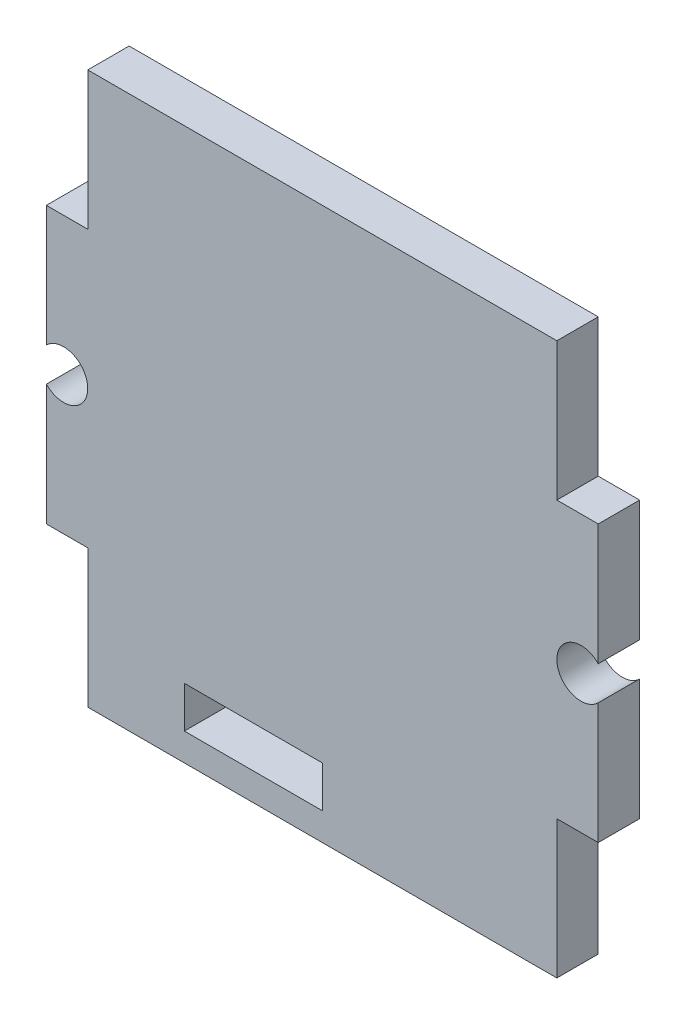
ISO-10303-21;
HEADER;
FILE_DESCRIPTION(('STEP AP214'),'2;1');
FILE_NAME('part.step','',(''),(''),'','','');
FILE_SCHEMA(('AUTOMOTIVE_DESIGN { 1 0 10303 214 1 1 1 1 }'));
ENDSEC;
DATA;
#1=APPLICATION_CONTEXT('core data for automotive mechanical design processes');
#2=APPLICATION_PROTOCOL_DEFINITION('international standard','automotive_design',2000,#1);
#3=PRODUCT_CONTEXT('',#1,'mechanical');
#4=PRODUCT('Part','Part','',(#3));
#5=PRODUCT_RELATED_PRODUCT_CATEGORY('part','',(#4));
#6=PRODUCT_DEFINITION_FORMATION('','',#4);
#7=PRODUCT_DEFINITION_CONTEXT('part definition',#1,'design');
#8=PRODUCT_DEFINITION('design','',#6,#7);
#9=PRODUCT_DEFINITION_SHAPE('','',#8);
#10=(LENGTH_UNIT() NAMED_UNIT(*) SI_UNIT(.MILLI.,.METRE.));
#11=(NAMED_UNIT(*) PLANE_ANGLE_UNIT() SI_UNIT($,.RADIAN.));
#12=(NAMED_UNIT(*) SI_UNIT($,.STERADIAN.) SOLID_ANGLE_UNIT());
#13=UNCERTAINTY_MEASURE_WITH_UNIT(LENGTH_MEASURE(1.E-05),#10,'distance_accuracy_value','');
#14=(GEOMETRIC_REPRESENTATION_CONTEXT(3) GLOBAL_UNCERTAINTY_ASSIGNED_CONTEXT((#13)) GLOBAL_UNIT_ASSIGNED_CONTEXT((#10,
#11,#12)) REPRESENTATION_CONTEXT('',''));
#15=CARTESIAN_POINT('',(0.,0.,0.));
#16=DIRECTION('',(0.,0.,1.));
#17=DIRECTION('',(1.,0.,0.));
#18=AXIS2_PLACEMENT_3D('',#15,#16,#17);
#19=CARTESIAN_POINT('',(-18.75,0.,1.5));
#20=DIRECTION('',(0.,0.,1.));
#21=DIRECTION('',(1.,0.,0.));
#22=AXIS2_PLACEMENT_3D('',#19,#20,#21);
#23=PLANE('',#22);
#24=CARTESIAN_POINT('',(-18.75,0.,1.5));
#25=DIRECTION('',(0.,0.,-1.));
#26=DIRECTION('',(1.,0.,0.));
#27=AXIS2_PLACEMENT_3D('',#24,#25,#26);
#28=CIRCLE('',#27,1.75);
#29=CARTESIAN_POINT('',(-20.,1.22474487139159,1.5));
#30=VERTEX_POINT('',#29);
#31=CARTESIAN_POINT('',(-20.,-1.22474487139159,1.5));
#32=VERTEX_POINT('',#31);
#33=EDGE_CURVE('E208',#30,#32,#28,.T.);
#34=ORIENTED_EDGE('',*,*,#33,.T.);
#35=DIRECTION('',(0.,-1.,0.));
#36=VECTOR('',#35,1.);
#37=CARTESIAN_POINT('',(-20.,-1.22474487139159,1.5));
#38=LINE('',#37,#36);
#39=CARTESIAN_POINT('',(-20.,-10.,1.5));
#40=VERTEX_POINT('',#39);
#41=EDGE_CURVE('E211',#32,#40,#38,.T.);
#42=ORIENTED_EDGE('',*,*,#41,.T.);
#43=DIRECTION('',(1.,0.,0.));
#44=VECTOR('',#43,1.);
#45=CARTESIAN_POINT('',(-17.,-10.,1.5));
#46=LINE('',#45,#44);
#47=CARTESIAN_POINT('',(-17.,-10.,1.5));
#48=VERTEX_POINT('',#47);
#49=EDGE_CURVE('E214',#40,#48,#46,.T.);
#50=ORIENTED_EDGE('',*,*,#49,.T.);
#51=DIRECTION('',(0.,-1.,0.));
#52=VECTOR('',#51,1.);
#53=CARTESIAN_POINT('',(-17.,-20.,1.5));
#54=LINE('',#53,#52);
#55=CARTESIAN_POINT('',(-17.,-20.,1.5));
#56=VERTEX_POINT('',#55);
#57=EDGE_CURVE('E216',#48,#56,#54,.T.);
#58=ORIENTED_EDGE('',*,*,#57,.T.);
#59=DIRECTION('',(1.,0.,0.));
#60=VECTOR('',#59,1.);
#61=CARTESIAN_POINT('',(-17.,-20.,1.5));
#62=LINE('',#61,#60);
#63=CARTESIAN_POINT('',(17.,-20.,1.5));
#64=VERTEX_POINT('',#63);
#65=EDGE_CURVE('E218',#56,#64,#62,.T.);
#66=ORIENTED_EDGE('',*,*,#65,.T.);
#67=DIRECTION('',(0.,1.,0.));
#68=VECTOR('',#67,1.);
#69=CARTESIAN_POINT('',(17.,-20.,1.5));
#70=LINE('',#69,#68);
#71=CARTESIAN_POINT('',(17.,-10.,1.5));
#72=VERTEX_POINT('',#71);
#73=EDGE_CURVE('E220',#64,#72,#70,.T.);
#74=ORIENTED_EDGE('',*,*,#73,.T.);
#75=DIRECTION('',(1.,0.,0.));
#76=VECTOR('',#75,1.);
#77=CARTESIAN_POINT('',(17.,-10.,1.5));
#78=LINE('',#77,#76);
#79=CARTESIAN_POINT('',(20.,-10.,1.5));
#80=VERTEX_POINT('',#79);
#81=EDGE_CURVE('E222',#72,#80,#78,.T.);
#82=ORIENTED_EDGE('',*,*,#81,.T.);
#83=DIRECTION('',(0.,1.,0.));
#84=VECTOR('',#83,1.);
#85=CARTESIAN_POINT('',(20.,-1.22474487139159,1.5));
#86=LINE('',#85,#84);
#87=CARTESIAN_POINT('',(20.,-1.22474487139159,1.5));
#88=VERTEX_POINT('',#87);
#89=EDGE_CURVE('E224',#80,#88,#86,.T.);
#90=ORIENTED_EDGE('',*,*,#89,.T.);
#91=CARTESIAN_POINT('',(18.75,0.,1.5));
#92=DIRECTION('',(0.,0.,-1.));
#93=DIRECTION('',(-1.,0.,0.));
#94=AXIS2_PLACEMENT_3D('',#91,#92,#93);
#95=CIRCLE('',#94,1.75);
#96=CARTESIAN_POINT('',(20.,1.22474487139159,1.5));
#97=VERTEX_POINT('',#96);
#98=EDGE_CURVE('E226',#88,#97,#95,.T.);
#99=ORIENTED_EDGE('',*,*,#98,.T.);
#100=DIRECTION('',(0.,1.,0.));
#101=VECTOR('',#100,1.);
#102=CARTESIAN_POINT('',(20.,10.,1.5));
#103=LINE('',#102,#101);
#104=CARTESIAN_POINT('',(20.,10.,1.5));
#105=VERTEX_POINT('',#104);
#106=EDGE_CURVE('E228',#97,#105,#103,.T.);
#107=ORIENTED_EDGE('',*,*,#106,.T.);
#108=DIRECTION('',(-1.,0.,0.));
#109=VECTOR('',#108,1.);
#110=CARTESIAN_POINT('',(17.,10.,1.5));
#111=LINE('',#110,#109);
#112=CARTESIAN_POINT('',(17.,10.,1.5));
#113=VERTEX_POINT('',#112);
#114=EDGE_CURVE('E230',#105,#113,#111,.T.);
#115=ORIENTED_EDGE('',*,*,#114,.T.);
#116=DIRECTION('',(0.,1.,0.));
#117=VECTOR('',#116,1.);
#118=CARTESIAN_POINT('',(17.,20.,1.5));
#119=LINE('',#118,#117);
#120=CARTESIAN_POINT('',(17.,20.,1.5));
#121=VERTEX_POINT('',#120);
#122=EDGE_CURVE('E232',#113,#121,#119,.T.);
#123=ORIENTED_EDGE('',*,*,#122,.T.);
#124=DIRECTION('',(-1.,0.,0.));
#125=VECTOR('',#124,1.);
#126=CARTESIAN_POINT('',(-17.,20.,1.5));
#127=LINE('',#126,#125);
#128=CARTESIAN_POINT('',(-17.,20.,1.5));
#129=VERTEX_POINT('',#128);
#130=EDGE_CURVE('E234',#121,#129,#127,.T.);
#131=ORIENTED_EDGE('',*,*,#130,.T.);
#132=DIRECTION('',(0.,-1.,0.));
#133=VECTOR('',#132,1.);
#134=CARTESIAN_POINT('',(-17.,20.,1.5));
#135=LINE('',#134,#133);
#136=CARTESIAN_POINT('',(-17.,10.,1.5));
#137=VERTEX_POINT('',#136);
#138=EDGE_CURVE('E236',#129,#137,#135,.T.);
#139=ORIENTED_EDGE('',*,*,#138,.T.);
#140=DIRECTION('',(-1.,0.,0.));
#141=VECTOR('',#140,1.);
#142=CARTESIAN_POINT('',(-17.,10.,1.5));
#143=LINE('',#142,#141);
#144=CARTESIAN_POINT('',(-20.,10.,1.5));
#145=VERTEX_POINT('',#144);
#146=EDGE_CURVE('E238',#137,#145,#143,.T.);
#147=ORIENTED_EDGE('',*,*,#146,.T.);
#148=DIRECTION('',(0.,-1.,0.));
#149=VECTOR('',#148,1.);
#150=CARTESIAN_POINT('',(-20.,10.,1.5));
#151=LINE('',#150,#149);
#152=EDGE_CURVE('E240',#145,#30,#151,.T.);
#153=ORIENTED_EDGE('',*,*,#152,.T.);
#154=EDGE_LOOP('',(#34,#42,#50,#58,#66,#74,#82,#90,#99,#107,#115,#123,#131,#139,#147,#153));
#155=FACE_BOUND('',#154,.T.);
#156=DIRECTION('',(1.,0.,0.));
#157=VECTOR('',#156,1.);
#158=CARTESIAN_POINT('',(-10.,-18.,1.5));
#159=LINE('',#158,#157);
#160=CARTESIAN_POINT('',(-10.,-18.,1.5));
#161=VERTEX_POINT('',#160);
#162=CARTESIAN_POINT('',(0.,-18.,1.5));
#163=VERTEX_POINT('',#162);
#164=EDGE_CURVE('E180',#161,#163,#159,.T.);
#165=ORIENTED_EDGE('',*,*,#164,.F.);
#166=DIRECTION('',(0.,-1.,0.));
#167=VECTOR('',#166,1.);
#168=CARTESIAN_POINT('',(-9.99999999999999,-15.,1.5));
#169=LINE('',#168,#167);
#170=CARTESIAN_POINT('',(-9.99999999999999,-15.,1.5));
#171=VERTEX_POINT('',#170);
#172=EDGE_CURVE('E172',#171,#161,#169,.T.);
#173=ORIENTED_EDGE('',*,*,#172,.F.);
#174=DIRECTION('',(-1.,0.,0.));
#175=VECTOR('',#174,1.);
#176=CARTESIAN_POINT('',(-9.99999999999999,-15.,1.5));
#177=LINE('',#176,#175);
#178=CARTESIAN_POINT('',(0.,-15.,1.5));
#179=VERTEX_POINT('',#178);
#180=EDGE_CURVE('E194',#179,#171,#177,.T.);
#181=ORIENTED_EDGE('',*,*,#180,.F.);
#182=DIRECTION('',(0.,1.,0.));
#183=VECTOR('',#182,1.);
#184=CARTESIAN_POINT('',(0.,-15.,1.5));
#185=LINE('',#184,#183);
#186=EDGE_CURVE('E192',#163,#179,#185,.T.);
#187=ORIENTED_EDGE('',*,*,#186,.F.);
#188=EDGE_LOOP('',(#165,#173,#181,#187));
#189=FACE_BOUND('',#188,.T.);
#190=ADVANCED_FACE('F35',(#155,#189),#23,.T.);
#191=CARTESIAN_POINT('',(-18.75,0.,-1.5));
#192=DIRECTION('',(0.,0.,1.));
#193=DIRECTION('',(1.,0.,0.));
#194=AXIS2_PLACEMENT_3D('',#191,#192,#193);
#195=PLANE('',#194);
#196=CARTESIAN_POINT('',(-18.75,0.,-1.5));
#197=DIRECTION('',(0.,0.,-1.));
#198=DIRECTION('',(1.,0.,0.));
#199=AXIS2_PLACEMENT_3D('',#196,#197,#198);
#200=CIRCLE('',#199,1.75);
#201=CARTESIAN_POINT('',(-20.,1.22474487139159,-1.5));
#202=VERTEX_POINT('',#201);
#203=CARTESIAN_POINT('',(-20.,-1.22474487139159,-1.5));
#204=VERTEX_POINT('',#203);
#205=EDGE_CURVE('E188',#202,#204,#200,.T.);
#206=ORIENTED_EDGE('',*,*,#205,.F.);
#207=DIRECTION('',(0.,-1.,0.));
#208=VECTOR('',#207,1.);
#209=CARTESIAN_POINT('',(-20.,10.,-1.5));
#210=LINE('',#209,#208);
#211=CARTESIAN_POINT('',(-20.,10.,-1.5));
#212=VERTEX_POINT('',#211);
#213=EDGE_CURVE('E212',#212,#202,#210,.T.);
#214=ORIENTED_EDGE('',*,*,#213,.F.);
#215=DIRECTION('',(-1.,0.,0.));
#216=VECTOR('',#215,1.);
#217=CARTESIAN_POINT('',(-17.,10.,-1.5));
#218=LINE('',#217,#216);
#219=CARTESIAN_POINT('',(-17.,10.,-1.5));
#220=VERTEX_POINT('',#219);
#221=EDGE_CURVE('E271',#220,#212,#218,.T.);
#222=ORIENTED_EDGE('',*,*,#221,.F.);
#223=DIRECTION('',(0.,-1.,0.));
#224=VECTOR('',#223,1.);
#225=CARTESIAN_POINT('',(-17.,20.,-1.5));
#226=LINE('',#225,#224);
#227=CARTESIAN_POINT('',(-17.,20.,-1.5));
#228=VERTEX_POINT('',#227);
#229=EDGE_CURVE('E269',#228,#220,#226,.T.);
#230=ORIENTED_EDGE('',*,*,#229,.F.);
#231=DIRECTION('',(-1.,0.,0.));
#232=VECTOR('',#231,1.);
#233=CARTESIAN_POINT('',(-17.,20.,-1.5));
#234=LINE('',#233,#232);
#235=CARTESIAN_POINT('',(17.,20.,-1.5));
#236=VERTEX_POINT('',#235);
#237=EDGE_CURVE('E267',#236,#228,#234,.T.);
#238=ORIENTED_EDGE('',*,*,#237,.F.);
#239=DIRECTION('',(0.,1.,0.));
#240=VECTOR('',#239,1.);
#241=CARTESIAN_POINT('',(17.,20.,-1.5));
#242=LINE('',#241,#240);
#243=CARTESIAN_POINT('',(17.,10.,-1.5));
#244=VERTEX_POINT('',#243);
#245=EDGE_CURVE('E265',#244,#236,#242,.T.);
#246=ORIENTED_EDGE('',*,*,#245,.F.);
#247=DIRECTION('',(-1.,0.,0.));
#248=VECTOR('',#247,1.);
#249=CARTESIAN_POINT('',(17.,10.,-1.5));
#250=LINE('',#249,#248);
#251=CARTESIAN_POINT('',(20.,10.,-1.5));
#252=VERTEX_POINT('',#251);
#253=EDGE_CURVE('E263',#252,#244,#250,.T.);
#254=ORIENTED_EDGE('',*,*,#253,.F.);
#255=DIRECTION('',(0.,1.,0.));
#256=VECTOR('',#255,1.);
#257=CARTESIAN_POINT('',(20.,10.,-1.5));
#258=LINE('',#257,#256);
#259=CARTESIAN_POINT('',(20.,1.22474487139159,-1.5));
#260=VERTEX_POINT('',#259);
#261=EDGE_CURVE('E261',#260,#252,#258,.T.);
#262=ORIENTED_EDGE('',*,*,#261,.F.);
#263=CARTESIAN_POINT('',(18.75,0.,-1.5));
#264=DIRECTION('',(0.,0.,-1.));
#265=DIRECTION('',(-1.,0.,0.));
#266=AXIS2_PLACEMENT_3D('',#263,#264,#265);
#267=CIRCLE('',#266,1.75);
#268=CARTESIAN_POINT('',(20.,-1.22474487139159,-1.5));
#269=VERTEX_POINT('',#268);
#270=EDGE_CURVE('E259',#269,#260,#267,.T.);
#271=ORIENTED_EDGE('',*,*,#270,.F.);
#272=DIRECTION('',(0.,1.,0.));
#273=VECTOR('',#272,1.);
#274=CARTESIAN_POINT('',(20.,-1.22474487139159,-1.5));
#275=LINE('',#274,#273);
#276=CARTESIAN_POINT('',(20.,-10.,-1.5));
#277=VERTEX_POINT('',#276);
#278=EDGE_CURVE('E257',#277,#269,#275,.T.);
#279=ORIENTED_EDGE('',*,*,#278,.F.);
#280=DIRECTION('',(1.,0.,0.));
#281=VECTOR('',#280,1.);
#282=CARTESIAN_POINT('',(17.,-10.,-1.5));
#283=LINE('',#282,#281);
#284=CARTESIAN_POINT('',(17.,-10.,-1.5));
#285=VERTEX_POINT('',#284);
#286=EDGE_CURVE('E255',#285,#277,#283,.T.);
#287=ORIENTED_EDGE('',*,*,#286,.F.);
#288=DIRECTION('',(0.,1.,0.));
#289=VECTOR('',#288,1.);
#290=CARTESIAN_POINT('',(17.,-20.,-1.5));
#291=LINE('',#290,#289);
#292=CARTESIAN_POINT('',(17.,-20.,-1.5));
#293=VERTEX_POINT('',#292);
#294=EDGE_CURVE('E253',#293,#285,#291,.T.);
#295=ORIENTED_EDGE('',*,*,#294,.F.);
#296=DIRECTION('',(1.,0.,0.));
#297=VECTOR('',#296,1.);
#298=CARTESIAN_POINT('',(-17.,-20.,-1.5));
#299=LINE('',#298,#297);
#300=CARTESIAN_POINT('',(-17.,-20.,-1.5));
#301=VERTEX_POINT('',#300);
#302=EDGE_CURVE('E251',#301,#293,#299,.T.);
#303=ORIENTED_EDGE('',*,*,#302,.F.);
#304=DIRECTION('',(0.,-1.,0.));
#305=VECTOR('',#304,1.);
#306=CARTESIAN_POINT('',(-17.,-20.,-1.5));
#307=LINE('',#306,#305);
#308=CARTESIAN_POINT('',(-17.,-10.,-1.5));
#309=VERTEX_POINT('',#308);
#310=EDGE_CURVE('E249',#309,#301,#307,.T.);
#311=ORIENTED_EDGE('',*,*,#310,.F.);
#312=DIRECTION('',(1.,0.,0.));
#313=VECTOR('',#312,1.);
#314=CARTESIAN_POINT('',(-17.,-10.,-1.5));
#315=LINE('',#314,#313);
#316=CARTESIAN_POINT('',(-20.,-10.,-1.5));
#317=VERTEX_POINT('',#316);
#318=EDGE_CURVE('E247',#317,#309,#315,.T.);
#319=ORIENTED_EDGE('',*,*,#318,.F.);
#320=DIRECTION('',(0.,-1.,0.));
#321=VECTOR('',#320,1.);
#322=CARTESIAN_POINT('',(-20.,-1.22474487139159,-1.5));
#323=LINE('',#322,#321);
#324=EDGE_CURVE('E245',#204,#317,#323,.T.);
#325=ORIENTED_EDGE('',*,*,#324,.F.);
#326=EDGE_LOOP('',(#206,#214,#222,#230,#238,#246,#254,#262,#271,#279,#287,#295,#303,#311,#319,#325));
#327=FACE_BOUND('',#326,.T.);
#328=DIRECTION('',(0.,-1.,0.));
#329=VECTOR('',#328,1.);
#330=CARTESIAN_POINT('',(-9.99999999999999,-15.,-1.5));
#331=LINE('',#330,#329);
#332=CARTESIAN_POINT('',(-9.99999999999999,-15.,-1.5));
#333=VERTEX_POINT('',#332);
#334=CARTESIAN_POINT('',(-10.,-18.,-1.5));
#335=VERTEX_POINT('',#334);
#336=EDGE_CURVE('E58',#333,#335,#331,.T.);
#337=ORIENTED_EDGE('',*,*,#336,.T.);
#338=DIRECTION('',(1.,0.,0.));
#339=VECTOR('',#338,1.);
#340=CARTESIAN_POINT('',(-10.,-18.,-1.5));
#341=LINE('',#340,#339);
#342=CARTESIAN_POINT('',(0.,-18.,-1.5));
#343=VERTEX_POINT('',#342);
#344=EDGE_CURVE('E187',#335,#343,#341,.T.);
#345=ORIENTED_EDGE('',*,*,#344,.T.);
#346=DIRECTION('',(0.,1.,0.));
#347=VECTOR('',#346,1.);
#348=CARTESIAN_POINT('',(0.,-15.,-1.5));
#349=LINE('',#348,#347);
#350=CARTESIAN_POINT('',(0.,-15.,-1.5));
#351=VERTEX_POINT('',#350);
#352=EDGE_CURVE('E200',#343,#351,#349,.T.);
#353=ORIENTED_EDGE('',*,*,#352,.T.);
#354=DIRECTION('',(-1.,0.,0.));
#355=VECTOR('',#354,1.);
#356=CARTESIAN_POINT('',(-9.99999999999999,-15.,-1.5));
#357=LINE('',#356,#355);
#358=EDGE_CURVE('E181',#351,#333,#357,.T.);
#359=ORIENTED_EDGE('',*,*,#358,.T.);
#360=EDGE_LOOP('',(#337,#345,#353,#359));
#361=FACE_BOUND('',#360,.T.);
#362=ADVANCED_FACE('F325',(#327,#361),#195,.F.);
#363=CARTESIAN_POINT('',(-18.75,0.,1.5));
#364=DIRECTION('',(0.,0.,-1.));
#365=DIRECTION('',(-1.,0.,0.));
#366=AXIS2_PLACEMENT_3D('',#363,#364,#365);
#367=CYLINDRICAL_SURFACE('',#366,1.75);
#368=ORIENTED_EDGE('',*,*,#205,.T.);
#369=DIRECTION('',(0.,0.,-1.));
#370=VECTOR('',#369,1.);
#371=CARTESIAN_POINT('',(-20.,-1.22474487139159,1.5));
#372=LINE('',#371,#370);
#373=EDGE_CURVE('E11',#32,#204,#372,.T.);
#374=ORIENTED_EDGE('',*,*,#373,.F.);
#375=ORIENTED_EDGE('',*,*,#33,.F.);
#376=DIRECTION('',(0.,0.,-1.));
#377=VECTOR('',#376,1.);
#378=CARTESIAN_POINT('',(-20.,1.22474487139159,1.5));
#379=LINE('',#378,#377);
#380=EDGE_CURVE('E242',#30,#202,#379,.T.);
#381=ORIENTED_EDGE('',*,*,#380,.T.);
#382=EDGE_LOOP('',(#368,#374,#375,#381));
#383=FACE_BOUND('',#382,.T.);
#384=ADVANCED_FACE('F37',(#383),#367,.F.);
#385=CARTESIAN_POINT('',(-20.,-1.22474487139159,1.5));
#386=DIRECTION('',(1.,0.,0.));
#387=DIRECTION('',(0.,0.,-1.));
#388=AXIS2_PLACEMENT_3D('',#385,#386,#387);
#389=PLANE('',#388);
#390=ORIENTED_EDGE('',*,*,#324,.T.);
#391=DIRECTION('',(0.,0.,-1.));
#392=VECTOR('',#391,1.);
#393=CARTESIAN_POINT('',(-20.,-10.,1.5));
#394=LINE('',#393,#392);
#395=EDGE_CURVE('E43',#40,#317,#394,.T.);
#396=ORIENTED_EDGE('',*,*,#395,.F.);
#397=ORIENTED_EDGE('',*,*,#41,.F.);
#398=ORIENTED_EDGE('',*,*,#373,.T.);
#399=EDGE_LOOP('',(#390,#396,#397,#398));
#400=FACE_BOUND('',#399,.T.);
#401=ADVANCED_FACE('F342',(#400),#389,.F.);
#402=CARTESIAN_POINT('',(-17.,-10.,1.5));
#403=DIRECTION('',(0.,1.,0.));
#404=DIRECTION('',(0.,0.,1.));
#405=AXIS2_PLACEMENT_3D('',#402,#403,#404);
#406=PLANE('',#405);
#407=ORIENTED_EDGE('',*,*,#318,.T.);
#408=DIRECTION('',(0.,0.,-1.));
#409=VECTOR('',#408,1.);
#410=CARTESIAN_POINT('',(-17.,-10.,1.5));
#411=LINE('',#410,#409);
#412=EDGE_CURVE('E312',#48,#309,#411,.T.);
#413=ORIENTED_EDGE('',*,*,#412,.F.);
#414=ORIENTED_EDGE('',*,*,#49,.F.);
#415=ORIENTED_EDGE('',*,*,#395,.T.);
#416=EDGE_LOOP('',(#407,#413,#414,#415));
#417=FACE_BOUND('',#416,.T.);
#418=ADVANCED_FACE('F319',(#417),#406,.F.);
#419=CARTESIAN_POINT('',(-17.,-20.,1.5));
#420=DIRECTION('',(1.,0.,0.));
#421=DIRECTION('',(0.,0.,-1.));
#422=AXIS2_PLACEMENT_3D('',#419,#420,#421);
#423=PLANE('',#422);
#424=ORIENTED_EDGE('',*,*,#310,.T.);
#425=DIRECTION('',(0.,0.,-1.));
#426=VECTOR('',#425,1.);
#427=CARTESIAN_POINT('',(-17.,-20.,1.5));
#428=LINE('',#427,#426);
#429=EDGE_CURVE('E309',#56,#301,#428,.T.);
#430=ORIENTED_EDGE('',*,*,#429,.F.);
#431=ORIENTED_EDGE('',*,*,#57,.F.);
#432=ORIENTED_EDGE('',*,*,#412,.T.);
#433=EDGE_LOOP('',(#424,#430,#431,#432));
#434=FACE_BOUND('',#433,.T.);
#435=ADVANCED_FACE('F331',(#434),#423,.F.);
#436=CARTESIAN_POINT('',(-17.,-20.,1.5));
#437=DIRECTION('',(0.,1.,0.));
#438=DIRECTION('',(0.,0.,1.));
#439=AXIS2_PLACEMENT_3D('',#436,#437,#438);
#440=PLANE('',#439);
#441=ORIENTED_EDGE('',*,*,#302,.T.);
#442=DIRECTION('',(0.,0.,-1.));
#443=VECTOR('',#442,1.);
#444=CARTESIAN_POINT('',(17.,-20.,1.5));
#445=LINE('',#444,#443);
#446=EDGE_CURVE('E306',#64,#293,#445,.T.);
#447=ORIENTED_EDGE('',*,*,#446,.F.);
#448=ORIENTED_EDGE('',*,*,#65,.F.);
#449=ORIENTED_EDGE('',*,*,#429,.T.);
#450=EDGE_LOOP('',(#441,#447,#448,#449));
#451=FACE_BOUND('',#450,.T.);
#452=ADVANCED_FACE('F335',(#451),#440,.F.);
#453=CARTESIAN_POINT('',(17.,-20.,1.5));
#454=DIRECTION('',(-1.,0.,0.));
#455=DIRECTION('',(0.,0.,1.));
#456=AXIS2_PLACEMENT_3D('',#453,#454,#455);
#457=PLANE('',#456);
#458=ORIENTED_EDGE('',*,*,#294,.T.);
#459=DIRECTION('',(0.,0.,-1.));
#460=VECTOR('',#459,1.);
#461=CARTESIAN_POINT('',(17.,-10.,1.5));
#462=LINE('',#461,#460);
#463=EDGE_CURVE('E303',#72,#285,#462,.T.);
#464=ORIENTED_EDGE('',*,*,#463,.F.);
#465=ORIENTED_EDGE('',*,*,#73,.F.);
#466=ORIENTED_EDGE('',*,*,#446,.T.);
#467=EDGE_LOOP('',(#458,#464,#465,#466));
#468=FACE_BOUND('',#467,.T.);
#469=ADVANCED_FACE('F395',(#468),#457,.F.);
#470=CARTESIAN_POINT('',(17.,-10.,1.5));
#471=DIRECTION('',(0.,1.,0.));
#472=DIRECTION('',(0.,0.,1.));
#473=AXIS2_PLACEMENT_3D('',#470,#471,#472);
#474=PLANE('',#473);
#475=ORIENTED_EDGE('',*,*,#286,.T.);
#476=DIRECTION('',(0.,0.,-1.));
#477=VECTOR('',#476,1.);
#478=CARTESIAN_POINT('',(20.,-10.,1.5));
#479=LINE('',#478,#477);
#480=EDGE_CURVE('E300',#80,#277,#479,.T.);
#481=ORIENTED_EDGE('',*,*,#480,.F.);
#482=ORIENTED_EDGE('',*,*,#81,.F.);
#483=ORIENTED_EDGE('',*,*,#463,.T.);
#484=EDGE_LOOP('',(#475,#481,#482,#483));
#485=FACE_BOUND('',#484,.T.);
#486=ADVANCED_FACE('F392',(#485),#474,.F.);
#487=CARTESIAN_POINT('',(20.,-1.22474487139159,1.5));
#488=DIRECTION('',(-1.,0.,0.));
#489=DIRECTION('',(0.,0.,1.));
#490=AXIS2_PLACEMENT_3D('',#487,#488,#489);
#491=PLANE('',#490);
#492=ORIENTED_EDGE('',*,*,#278,.T.);
#493=DIRECTION('',(0.,0.,-1.));
#494=VECTOR('',#493,1.);
#495=CARTESIAN_POINT('',(20.,-1.22474487139159,1.5));
#496=LINE('',#495,#494);
#497=EDGE_CURVE('E297',#88,#269,#496,.T.);
#498=ORIENTED_EDGE('',*,*,#497,.F.);
#499=ORIENTED_EDGE('',*,*,#89,.F.);
#500=ORIENTED_EDGE('',*,*,#480,.T.);
#501=EDGE_LOOP('',(#492,#498,#499,#500));
#502=FACE_BOUND('',#501,.T.);
#503=ADVANCED_FACE('F388',(#502),#491,.F.);
#504=CARTESIAN_POINT('',(18.75,0.,1.5));
#505=DIRECTION('',(0.,0.,-1.));
#506=DIRECTION('',(-1.,0.,0.));
#507=AXIS2_PLACEMENT_3D('',#504,#505,#506);
#508=CYLINDRICAL_SURFACE('',#507,1.75);
#509=ORIENTED_EDGE('',*,*,#270,.T.);
#510=DIRECTION('',(0.,0.,-1.));
#511=VECTOR('',#510,1.);
#512=CARTESIAN_POINT('',(20.,1.22474487139159,1.5));
#513=LINE('',#512,#511);
#514=EDGE_CURVE('E294',#97,#260,#513,.T.);
#515=ORIENTED_EDGE('',*,*,#514,.F.);
#516=ORIENTED_EDGE('',*,*,#98,.F.);
#517=ORIENTED_EDGE('',*,*,#497,.T.);
#518=EDGE_LOOP('',(#509,#515,#516,#517));
#519=FACE_BOUND('',#518,.T.);
#520=ADVANCED_FACE('F384',(#519),#508,.F.);
#521=CARTESIAN_POINT('',(20.,10.,1.5));
#522=DIRECTION('',(-1.,0.,0.));
#523=DIRECTION('',(0.,0.,1.));
#524=AXIS2_PLACEMENT_3D('',#521,#522,#523);
#525=PLANE('',#524);
#526=ORIENTED_EDGE('',*,*,#261,.T.);
#527=DIRECTION('',(0.,0.,-1.));
#528=VECTOR('',#527,1.);
#529=CARTESIAN_POINT('',(20.,10.,1.5));
#530=LINE('',#529,#528);
#531=EDGE_CURVE('E291',#105,#252,#530,.T.);
#532=ORIENTED_EDGE('',*,*,#531,.F.);
#533=ORIENTED_EDGE('',*,*,#106,.F.);
#534=ORIENTED_EDGE('',*,*,#514,.T.);
#535=EDGE_LOOP('',(#526,#532,#533,#534));
#536=FACE_BOUND('',#535,.T.);
#537=ADVANCED_FACE('F379',(#536),#525,.F.);
#538=CARTESIAN_POINT('',(17.,10.,1.5));
#539=DIRECTION('',(0.,-1.,0.));
#540=DIRECTION('',(0.,0.,-1.));
#541=AXIS2_PLACEMENT_3D('',#538,#539,#540);
#542=PLANE('',#541);
#543=ORIENTED_EDGE('',*,*,#253,.T.);
#544=DIRECTION('',(0.,0.,-1.));
#545=VECTOR('',#544,1.);
#546=CARTESIAN_POINT('',(17.,10.,1.5));
#547=LINE('',#546,#545);
#548=EDGE_CURVE('E288',#113,#244,#547,.T.);
#549=ORIENTED_EDGE('',*,*,#548,.F.);
#550=ORIENTED_EDGE('',*,*,#114,.F.);
#551=ORIENTED_EDGE('',*,*,#531,.T.);
#552=EDGE_LOOP('',(#543,#549,#550,#551));
#553=FACE_BOUND('',#552,.T.);
#554=ADVANCED_FACE('F373',(#553),#542,.F.);
#555=CARTESIAN_POINT('',(17.,20.,1.5));
#556=DIRECTION('',(-1.,0.,0.));
#557=DIRECTION('',(0.,0.,1.));
#558=AXIS2_PLACEMENT_3D('',#555,#556,#557);
#559=PLANE('',#558);
#560=ORIENTED_EDGE('',*,*,#245,.T.);
#561=DIRECTION('',(0.,0.,-1.));
#562=VECTOR('',#561,1.);
#563=CARTESIAN_POINT('',(17.,20.,1.5));
#564=LINE('',#563,#562);
#565=EDGE_CURVE('E285',#121,#236,#564,.T.);
#566=ORIENTED_EDGE('',*,*,#565,.F.);
#567=ORIENTED_EDGE('',*,*,#122,.F.);
#568=ORIENTED_EDGE('',*,*,#548,.T.);
#569=EDGE_LOOP('',(#560,#566,#567,#568));
#570=FACE_BOUND('',#569,.T.);
#571=ADVANCED_FACE('F369',(#570),#559,.F.);
#572=CARTESIAN_POINT('',(-17.,20.,1.5));
#573=DIRECTION('',(0.,-1.,0.));
#574=DIRECTION('',(0.,0.,-1.));
#575=AXIS2_PLACEMENT_3D('',#572,#573,#574);
#576=PLANE('',#575);
#577=ORIENTED_EDGE('',*,*,#237,.T.);
#578=DIRECTION('',(0.,0.,-1.));
#579=VECTOR('',#578,1.);
#580=CARTESIAN_POINT('',(-17.,20.,1.5));
#581=LINE('',#580,#579);
#582=EDGE_CURVE('E282',#129,#228,#581,.T.);
#583=ORIENTED_EDGE('',*,*,#582,.F.);
#584=ORIENTED_EDGE('',*,*,#130,.F.);
#585=ORIENTED_EDGE('',*,*,#565,.T.);
#586=EDGE_LOOP('',(#577,#583,#584,#585));
#587=FACE_BOUND('',#586,.T.);
#588=ADVANCED_FACE('F364',(#587),#576,.F.);
#589=CARTESIAN_POINT('',(-17.,20.,1.5));
#590=DIRECTION('',(1.,0.,0.));
#591=DIRECTION('',(0.,0.,-1.));
#592=AXIS2_PLACEMENT_3D('',#589,#590,#591);
#593=PLANE('',#592);
#594=ORIENTED_EDGE('',*,*,#229,.T.);
#595=DIRECTION('',(0.,0.,-1.));
#596=VECTOR('',#595,1.);
#597=CARTESIAN_POINT('',(-17.,10.,1.5));
#598=LINE('',#597,#596);
#599=EDGE_CURVE('E279',#137,#220,#598,.T.);
#600=ORIENTED_EDGE('',*,*,#599,.F.);
#601=ORIENTED_EDGE('',*,*,#138,.F.);
#602=ORIENTED_EDGE('',*,*,#582,.T.);
#603=EDGE_LOOP('',(#594,#600,#601,#602));
#604=FACE_BOUND('',#603,.T.);
#605=ADVANCED_FACE('F358',(#604),#593,.F.);
#606=CARTESIAN_POINT('',(-17.,10.,1.5));
#607=DIRECTION('',(0.,-1.,0.));
#608=DIRECTION('',(0.,0.,-1.));
#609=AXIS2_PLACEMENT_3D('',#606,#607,#608);
#610=PLANE('',#609);
#611=ORIENTED_EDGE('',*,*,#221,.T.);
#612=DIRECTION('',(0.,0.,-1.));
#613=VECTOR('',#612,1.);
#614=CARTESIAN_POINT('',(-20.,10.,1.5));
#615=LINE('',#614,#613);
#616=EDGE_CURVE('E276',#145,#212,#615,.T.);
#617=ORIENTED_EDGE('',*,*,#616,.F.);
#618=ORIENTED_EDGE('',*,*,#146,.F.);
#619=ORIENTED_EDGE('',*,*,#599,.T.);
#620=EDGE_LOOP('',(#611,#617,#618,#619));
#621=FACE_BOUND('',#620,.T.);
#622=ADVANCED_FACE('F354',(#621),#610,.F.);
#623=CARTESIAN_POINT('',(-20.,10.,1.5));
#624=DIRECTION('',(1.,0.,0.));
#625=DIRECTION('',(0.,0.,-1.));
#626=AXIS2_PLACEMENT_3D('',#623,#624,#625);
#627=PLANE('',#626);
#628=ORIENTED_EDGE('',*,*,#213,.T.);
#629=ORIENTED_EDGE('',*,*,#380,.F.);
#630=ORIENTED_EDGE('',*,*,#152,.F.);
#631=ORIENTED_EDGE('',*,*,#616,.T.);
#632=EDGE_LOOP('',(#628,#629,#630,#631));
#633=FACE_BOUND('',#632,.T.);
#634=ADVANCED_FACE('F349',(#633),#627,.F.);
#635=CARTESIAN_POINT('',(-9.99999999999999,-15.,1.5));
#636=DIRECTION('',(1.,0.,0.));
#637=DIRECTION('',(0.,1.,0.));
#638=AXIS2_PLACEMENT_3D('',#635,#636,#637);
#639=PLANE('',#638);
#640=ORIENTED_EDGE('',*,*,#336,.F.);
#641=DIRECTION('',(0.,0.,-1.));
#642=VECTOR('',#641,1.);
#643=CARTESIAN_POINT('',(-9.99999999999999,-15.,1.5));
#644=LINE('',#643,#642);
#645=EDGE_CURVE('E176',#171,#333,#644,.T.);
#646=ORIENTED_EDGE('',*,*,#645,.F.);
#647=ORIENTED_EDGE('',*,*,#172,.T.);
#648=DIRECTION('',(0.,0.,-1.));
#649=VECTOR('',#648,1.);
#650=CARTESIAN_POINT('',(-10.,-18.,1.5));
#651=LINE('',#650,#649);
#652=EDGE_CURVE('E175',#161,#335,#651,.T.);
#653=ORIENTED_EDGE('',*,*,#652,.T.);
#654=EDGE_LOOP('',(#640,#646,#647,#653));
#655=FACE_BOUND('',#654,.T.);
#656=ADVANCED_FACE('F174',(#655),#639,.T.);
#657=CARTESIAN_POINT('',(-10.,-18.,1.5));
#658=DIRECTION('',(0.,1.,0.));
#659=DIRECTION('',(0.,0.,1.));
#660=AXIS2_PLACEMENT_3D('',#657,#658,#659);
#661=PLANE('',#660);
#662=ORIENTED_EDGE('',*,*,#344,.F.);
#663=ORIENTED_EDGE('',*,*,#652,.F.);
#664=ORIENTED_EDGE('',*,*,#164,.T.);
#665=DIRECTION('',(0.,0.,-1.));
#666=VECTOR('',#665,1.);
#667=CARTESIAN_POINT('',(0.,-18.,1.5));
#668=LINE('',#667,#666);
#669=EDGE_CURVE('E189',#163,#343,#668,.T.);
#670=ORIENTED_EDGE('',*,*,#669,.T.);
#671=EDGE_LOOP('',(#662,#663,#664,#670));
#672=FACE_BOUND('',#671,.T.);
#673=ADVANCED_FACE('F184',(#672),#661,.T.);
#674=CARTESIAN_POINT('',(0.,-15.,1.5));
#675=DIRECTION('',(-1.,0.,0.));
#676=DIRECTION('',(0.,0.,1.));
#677=AXIS2_PLACEMENT_3D('',#674,#675,#676);
#678=PLANE('',#677);
#679=ORIENTED_EDGE('',*,*,#352,.F.);
#680=ORIENTED_EDGE('',*,*,#669,.F.);
#681=ORIENTED_EDGE('',*,*,#186,.T.);
#682=DIRECTION('',(0.,0.,-1.));
#683=VECTOR('',#682,1.);
#684=CARTESIAN_POINT('',(0.,-15.,1.5));
#685=LINE('',#684,#683);
#686=EDGE_CURVE('E50',#179,#351,#685,.T.);
#687=ORIENTED_EDGE('',*,*,#686,.T.);
#688=EDGE_LOOP('',(#679,#680,#681,#687));
#689=FACE_BOUND('',#688,.T.);
#690=ADVANCED_FACE('F477',(#689),#678,.T.);
#691=CARTESIAN_POINT('',(-9.99999999999999,-15.,1.5));
#692=DIRECTION('',(0.,-1.,0.));
#693=DIRECTION('',(0.,0.,-1.));
#694=AXIS2_PLACEMENT_3D('',#691,#692,#693);
#695=PLANE('',#694);
#696=ORIENTED_EDGE('',*,*,#358,.F.);
#697=ORIENTED_EDGE('',*,*,#686,.F.);
#698=ORIENTED_EDGE('',*,*,#180,.T.);
#699=ORIENTED_EDGE('',*,*,#645,.T.);
#700=EDGE_LOOP('',(#696,#697,#698,#699));
#701=FACE_BOUND('',#700,.T.);
#702=ADVANCED_FACE('F483',(#701),#695,.T.);
#703=CLOSED_SHELL('',(#190,#362,#384,#401,#418,#435,#452,#469,#486,#503,#520,#537,#554,#571,
#588,#605,#622,#634,#656,#673,#690,#702));
#704=MANIFOLD_SOLID_BREP('B2',#703);
#705=ADVANCED_BREP_SHAPE_REPRESENTATION('',(#18,#704),#14);
#706=SHAPE_DEFINITION_REPRESENTATION(#9,#705);
ENDSEC;
END-ISO-10303-21;
